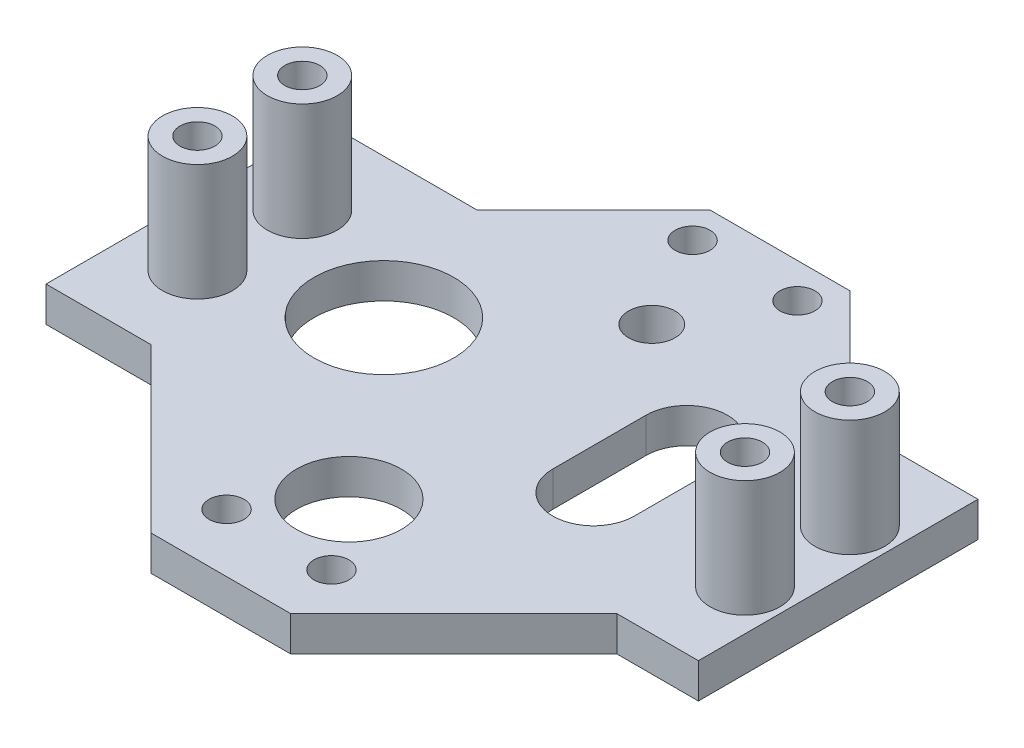
ISO-10303-21;
HEADER;
FILE_DESCRIPTION(('STEP AP214'),'2;1');
FILE_NAME('part.step','',(''),(''),'','','');
FILE_SCHEMA(('AUTOMOTIVE_DESIGN { 1 0 10303 214 1 1 1 1 }'));
ENDSEC;
DATA;
#1=APPLICATION_CONTEXT('core data for automotive mechanical design processes');
#2=APPLICATION_PROTOCOL_DEFINITION('international standard','automotive_design',2000,#1);
#3=PRODUCT_CONTEXT('',#1,'mechanical');
#4=PRODUCT('Part','Part','',(#3));
#5=PRODUCT_RELATED_PRODUCT_CATEGORY('part','',(#4));
#6=PRODUCT_DEFINITION_FORMATION('','',#4);
#7=PRODUCT_DEFINITION_CONTEXT('part definition',#1,'design');
#8=PRODUCT_DEFINITION('design','',#6,#7);
#9=PRODUCT_DEFINITION_SHAPE('','',#8);
#10=(LENGTH_UNIT() NAMED_UNIT(*) SI_UNIT(.MILLI.,.METRE.));
#11=(NAMED_UNIT(*) PLANE_ANGLE_UNIT() SI_UNIT($,.RADIAN.));
#12=(NAMED_UNIT(*) SI_UNIT($,.STERADIAN.) SOLID_ANGLE_UNIT());
#13=UNCERTAINTY_MEASURE_WITH_UNIT(LENGTH_MEASURE(1.E-05),#10,'distance_accuracy_value','');
#14=(GEOMETRIC_REPRESENTATION_CONTEXT(3) GLOBAL_UNCERTAINTY_ASSIGNED_CONTEXT((#13)) GLOBAL_UNIT_ASSIGNED_CONTEXT((#10,
#11,#12)) REPRESENTATION_CONTEXT('',''));
#15=CARTESIAN_POINT('',(0.,0.,0.));
#16=DIRECTION('',(0.,0.,1.));
#17=DIRECTION('',(1.,0.,0.));
#18=AXIS2_PLACEMENT_3D('',#15,#16,#17);
#19=CARTESIAN_POINT('',(0.,3.,-38.));
#20=DIRECTION('',(0.,0.,-1.));
#21=DIRECTION('',(-1.,0.,0.));
#22=AXIS2_PLACEMENT_3D('',#19,#20,#21);
#23=PLANE('',#22);
#24=DIRECTION('',(1.,0.,0.));
#25=VECTOR('',#24,1.);
#26=CARTESIAN_POINT('',(0.,0.,-38.));
#27=LINE('',#26,#25);
#28=CARTESIAN_POINT('',(22.0000000000003,0.,-38.));
#29=VERTEX_POINT('',#28);
#30=CARTESIAN_POINT('',(33.,0.,-38.));
#31=VERTEX_POINT('',#30);
#32=EDGE_CURVE('E250',#29,#31,#27,.T.);
#33=ORIENTED_EDGE('',*,*,#32,.F.);
#34=DIRECTION('',(0.,-1.,0.));
#35=VECTOR('',#34,1.);
#36=CARTESIAN_POINT('',(22.0000000000003,3.,-38.));
#37=LINE('',#36,#35);
#38=CARTESIAN_POINT('',(22.0000000000003,3.,-38.));
#39=VERTEX_POINT('',#38);
#40=EDGE_CURVE('E11',#39,#29,#37,.T.);
#41=ORIENTED_EDGE('',*,*,#40,.F.);
#42=DIRECTION('',(1.,0.,0.));
#43=VECTOR('',#42,1.);
#44=CARTESIAN_POINT('',(0.,3.,-38.));
#45=LINE('',#44,#43);
#46=CARTESIAN_POINT('',(33.,3.,-38.));
#47=VERTEX_POINT('',#46);
#48=EDGE_CURVE('E253',#39,#47,#45,.T.);
#49=ORIENTED_EDGE('',*,*,#48,.T.);
#50=DIRECTION('',(0.,-1.,0.));
#51=VECTOR('',#50,1.);
#52=CARTESIAN_POINT('',(33.,3.,-38.));
#53=LINE('',#52,#51);
#54=EDGE_CURVE('E284',#47,#31,#53,.T.);
#55=ORIENTED_EDGE('',*,*,#54,.T.);
#56=EDGE_LOOP('',(#33,#41,#49,#55));
#57=FACE_BOUND('',#56,.T.);
#58=ADVANCED_FACE('F34',(#57),#23,.T.);
#59=CARTESIAN_POINT('',(29.9999999999999,3.,-30.0000000000006));
#60=DIRECTION('',(0.707106781186539,0.,-0.707106781186556));
#61=DIRECTION('',(-0.707106781186556,0.,-0.707106781186539));
#62=AXIS2_PLACEMENT_3D('',#59,#60,#61);
#63=PLANE('',#62);
#64=DIRECTION('',(0.707106781186556,0.,0.707106781186539));
#65=VECTOR('',#64,1.);
#66=CARTESIAN_POINT('',(29.9999999999999,0.,-30.0000000000006));
#67=LINE('',#66,#65);
#68=CARTESIAN_POINT('',(12.,0.,-48.));
#69=VERTEX_POINT('',#68);
#70=EDGE_CURVE('E287',#69,#29,#67,.T.);
#71=ORIENTED_EDGE('',*,*,#70,.F.);
#72=DIRECTION('',(0.,-1.,0.));
#73=VECTOR('',#72,1.);
#74=CARTESIAN_POINT('',(12.,3.,-48.));
#75=LINE('',#74,#73);
#76=CARTESIAN_POINT('',(12.,3.,-48.));
#77=VERTEX_POINT('',#76);
#78=EDGE_CURVE('E41',#77,#69,#75,.T.);
#79=ORIENTED_EDGE('',*,*,#78,.F.);
#80=DIRECTION('',(0.707106781186556,0.,0.707106781186539));
#81=VECTOR('',#80,1.);
#82=CARTESIAN_POINT('',(29.9999999999999,3.,-30.0000000000006));
#83=LINE('',#82,#81);
#84=EDGE_CURVE('E256',#77,#39,#83,.T.);
#85=ORIENTED_EDGE('',*,*,#84,.T.);
#86=ORIENTED_EDGE('',*,*,#40,.T.);
#87=EDGE_LOOP('',(#71,#79,#85,#86));
#88=FACE_BOUND('',#87,.T.);
#89=ADVANCED_FACE('F344',(#88),#63,.T.);
#90=CARTESIAN_POINT('',(0.,3.,-48.));
#91=DIRECTION('',(0.,0.,-1.));
#92=DIRECTION('',(-1.,0.,0.));
#93=AXIS2_PLACEMENT_3D('',#90,#91,#92);
#94=PLANE('',#93);
#95=DIRECTION('',(1.,0.,0.));
#96=VECTOR('',#95,1.);
#97=CARTESIAN_POINT('',(0.,0.,-48.));
#98=LINE('',#97,#96);
#99=CARTESIAN_POINT('',(0.,0.,-48.));
#100=VERTEX_POINT('',#99);
#101=EDGE_CURVE('E290',#100,#69,#98,.T.);
#102=ORIENTED_EDGE('',*,*,#101,.F.);
#103=DIRECTION('',(0.,-1.,0.));
#104=VECTOR('',#103,1.);
#105=CARTESIAN_POINT('',(0.,3.,-48.));
#106=LINE('',#105,#104);
#107=CARTESIAN_POINT('',(0.,3.,-48.));
#108=VERTEX_POINT('',#107);
#109=EDGE_CURVE('E336',#108,#100,#106,.T.);
#110=ORIENTED_EDGE('',*,*,#109,.F.);
#111=DIRECTION('',(1.,0.,0.));
#112=VECTOR('',#111,1.);
#113=CARTESIAN_POINT('',(0.,3.,-48.));
#114=LINE('',#113,#112);
#115=EDGE_CURVE('E260',#108,#77,#114,.T.);
#116=ORIENTED_EDGE('',*,*,#115,.T.);
#117=ORIENTED_EDGE('',*,*,#78,.T.);
#118=EDGE_LOOP('',(#102,#110,#116,#117));
#119=FACE_BOUND('',#118,.T.);
#120=ADVANCED_FACE('F340',(#119),#94,.T.);
#121=CARTESIAN_POINT('',(-24.,3.,-23.9999999999996));
#122=DIRECTION('',(0.707106781186553,0.,0.707106781186541));
#123=DIRECTION('',(0.707106781186542,0.,-0.707106781186554));
#124=AXIS2_PLACEMENT_3D('',#121,#122,#123);
#125=PLANE('',#124);
#126=DIRECTION('',(-0.707106781186542,0.,0.707106781186554));
#127=VECTOR('',#126,1.);
#128=CARTESIAN_POINT('',(-24.,0.,-23.9999999999996));
#129=LINE('',#128,#127);
#130=CARTESIAN_POINT('',(-9.99999999999987,0.,-38.));
#131=VERTEX_POINT('',#130);
#132=EDGE_CURVE('E293',#100,#131,#129,.T.);
#133=ORIENTED_EDGE('',*,*,#132,.T.);
#134=DIRECTION('',(0.,-1.,0.));
#135=VECTOR('',#134,1.);
#136=CARTESIAN_POINT('',(-9.99999999999987,3.,-38.));
#137=LINE('',#136,#135);
#138=CARTESIAN_POINT('',(-9.99999999999987,3.,-38.));
#139=VERTEX_POINT('',#138);
#140=EDGE_CURVE('E334',#139,#131,#137,.T.);
#141=ORIENTED_EDGE('',*,*,#140,.F.);
#142=DIRECTION('',(-0.707106781186542,0.,0.707106781186554));
#143=VECTOR('',#142,1.);
#144=CARTESIAN_POINT('',(-24.,3.,-23.9999999999996));
#145=LINE('',#144,#143);
#146=EDGE_CURVE('E263',#108,#139,#145,.T.);
#147=ORIENTED_EDGE('',*,*,#146,.F.);
#148=ORIENTED_EDGE('',*,*,#109,.T.);
#149=EDGE_LOOP('',(#133,#141,#147,#148));
#150=FACE_BOUND('',#149,.T.);
#151=ADVANCED_FACE('F352',(#150),#125,.F.);
#152=CARTESIAN_POINT('',(0.,3.,-38.));
#153=DIRECTION('',(0.,0.,-1.));
#154=DIRECTION('',(-1.,0.,0.));
#155=AXIS2_PLACEMENT_3D('',#152,#153,#154);
#156=PLANE('',#155);
#157=DIRECTION('',(1.,0.,0.));
#158=VECTOR('',#157,1.);
#159=CARTESIAN_POINT('',(0.,0.,-38.));
#160=LINE('',#159,#158);
#161=CARTESIAN_POINT('',(-23.,0.,-38.));
#162=VERTEX_POINT('',#161);
#163=EDGE_CURVE('E296',#162,#131,#160,.T.);
#164=ORIENTED_EDGE('',*,*,#163,.F.);
#165=DIRECTION('',(0.,-1.,0.));
#166=VECTOR('',#165,1.);
#167=CARTESIAN_POINT('',(-23.,3.,-38.));
#168=LINE('',#167,#166);
#169=CARTESIAN_POINT('',(-23.,3.,-38.));
#170=VERTEX_POINT('',#169);
#171=EDGE_CURVE('E332',#170,#162,#168,.T.);
#172=ORIENTED_EDGE('',*,*,#171,.F.);
#173=DIRECTION('',(1.,0.,0.));
#174=VECTOR('',#173,1.);
#175=CARTESIAN_POINT('',(0.,3.,-38.));
#176=LINE('',#175,#174);
#177=EDGE_CURVE('E265',#170,#139,#176,.T.);
#178=ORIENTED_EDGE('',*,*,#177,.T.);
#179=ORIENTED_EDGE('',*,*,#140,.T.);
#180=EDGE_LOOP('',(#164,#172,#178,#179));
#181=FACE_BOUND('',#180,.T.);
#182=ADVANCED_FACE('F392',(#181),#156,.T.);
#183=CARTESIAN_POINT('',(-23.,3.,0.));
#184=DIRECTION('',(1.,0.,0.));
#185=DIRECTION('',(0.,0.,-1.));
#186=AXIS2_PLACEMENT_3D('',#183,#184,#185);
#187=PLANE('',#186);
#188=DIRECTION('',(0.,0.,1.));
#189=VECTOR('',#188,1.);
#190=CARTESIAN_POINT('',(-23.,0.,0.));
#191=LINE('',#190,#189);
#192=CARTESIAN_POINT('',(-23.,0.,-14.));
#193=VERTEX_POINT('',#192);
#194=EDGE_CURVE('E299',#162,#193,#191,.T.);
#195=ORIENTED_EDGE('',*,*,#194,.T.);
#196=DIRECTION('',(0.,-1.,0.));
#197=VECTOR('',#196,1.);
#198=CARTESIAN_POINT('',(-23.,3.,-14.));
#199=LINE('',#198,#197);
#200=CARTESIAN_POINT('',(-23.,3.,-14.));
#201=VERTEX_POINT('',#200);
#202=EDGE_CURVE('E329',#201,#193,#199,.T.);
#203=ORIENTED_EDGE('',*,*,#202,.F.);
#204=DIRECTION('',(0.,0.,1.));
#205=VECTOR('',#204,1.);
#206=CARTESIAN_POINT('',(-23.,3.,0.));
#207=LINE('',#206,#205);
#208=EDGE_CURVE('E268',#170,#201,#207,.T.);
#209=ORIENTED_EDGE('',*,*,#208,.F.);
#210=ORIENTED_EDGE('',*,*,#171,.T.);
#211=EDGE_LOOP('',(#195,#203,#209,#210));
#212=FACE_BOUND('',#211,.T.);
#213=ADVANCED_FACE('F390',(#212),#187,.F.);
#214=CARTESIAN_POINT('',(0.,3.,-14.));
#215=DIRECTION('',(0.,0.,-1.));
#216=DIRECTION('',(-1.,0.,0.));
#217=AXIS2_PLACEMENT_3D('',#214,#215,#216);
#218=PLANE('',#217);
#219=DIRECTION('',(1.,0.,0.));
#220=VECTOR('',#219,1.);
#221=CARTESIAN_POINT('',(0.,0.,-14.));
#222=LINE('',#221,#220);
#223=CARTESIAN_POINT('',(-14.,0.,-14.));
#224=VERTEX_POINT('',#223);
#225=EDGE_CURVE('E301',#193,#224,#222,.T.);
#226=ORIENTED_EDGE('',*,*,#225,.T.);
#227=DIRECTION('',(0.,-1.,0.));
#228=VECTOR('',#227,1.);
#229=CARTESIAN_POINT('',(-14.,3.,-14.));
#230=LINE('',#229,#228);
#231=CARTESIAN_POINT('',(-14.,3.,-14.));
#232=VERTEX_POINT('',#231);
#233=EDGE_CURVE('E327',#232,#224,#230,.T.);
#234=ORIENTED_EDGE('',*,*,#233,.F.);
#235=DIRECTION('',(1.,0.,0.));
#236=VECTOR('',#235,1.);
#237=CARTESIAN_POINT('',(0.,3.,-14.));
#238=LINE('',#237,#236);
#239=EDGE_CURVE('E270',#201,#232,#238,.T.);
#240=ORIENTED_EDGE('',*,*,#239,.F.);
#241=ORIENTED_EDGE('',*,*,#202,.T.);
#242=EDGE_LOOP('',(#226,#234,#240,#241));
#243=FACE_BOUND('',#242,.T.);
#244=ADVANCED_FACE('F385',(#243),#218,.F.);
#245=CARTESIAN_POINT('',(0.,3.,0.));
#246=DIRECTION('',(-0.707106781186546,0.,0.707106781186549));
#247=DIRECTION('',(0.707106781186549,0.,0.707106781186546));
#248=AXIS2_PLACEMENT_3D('',#245,#246,#247);
#249=PLANE('',#248);
#250=DIRECTION('',(-0.707106781186549,0.,-0.707106781186546));
#251=VECTOR('',#250,1.);
#252=CARTESIAN_POINT('',(0.,0.,0.));
#253=LINE('',#252,#251);
#254=CARTESIAN_POINT('',(0.,0.,0.));
#255=VERTEX_POINT('',#254);
#256=EDGE_CURVE('E304',#255,#224,#253,.T.);
#257=ORIENTED_EDGE('',*,*,#256,.F.);
#258=DIRECTION('',(0.,-1.,0.));
#259=VECTOR('',#258,1.);
#260=CARTESIAN_POINT('',(0.,3.,0.));
#261=LINE('',#260,#259);
#262=CARTESIAN_POINT('',(0.,3.,0.));
#263=VERTEX_POINT('',#262);
#264=EDGE_CURVE('E325',#263,#255,#261,.T.);
#265=ORIENTED_EDGE('',*,*,#264,.F.);
#266=DIRECTION('',(-0.707106781186549,0.,-0.707106781186546));
#267=VECTOR('',#266,1.);
#268=CARTESIAN_POINT('',(0.,3.,0.));
#269=LINE('',#268,#267);
#270=EDGE_CURVE('E272',#263,#232,#269,.T.);
#271=ORIENTED_EDGE('',*,*,#270,.T.);
#272=ORIENTED_EDGE('',*,*,#233,.T.);
#273=EDGE_LOOP('',(#257,#265,#271,#272));
#274=FACE_BOUND('',#273,.T.);
#275=ADVANCED_FACE('F381',(#274),#249,.T.);
#276=CARTESIAN_POINT('',(0.,3.,0.));
#277=DIRECTION('',(0.,0.,-1.));
#278=DIRECTION('',(-1.,0.,0.));
#279=AXIS2_PLACEMENT_3D('',#276,#277,#278);
#280=PLANE('',#279);
#281=DIRECTION('',(1.,0.,0.));
#282=VECTOR('',#281,1.);
#283=CARTESIAN_POINT('',(0.,0.,0.));
#284=LINE('',#283,#282);
#285=CARTESIAN_POINT('',(12.,0.,0.));
#286=VERTEX_POINT('',#285);
#287=EDGE_CURVE('E307',#255,#286,#284,.T.);
#288=ORIENTED_EDGE('',*,*,#287,.T.);
#289=DIRECTION('',(0.,-1.,0.));
#290=VECTOR('',#289,1.);
#291=CARTESIAN_POINT('',(12.,3.,0.));
#292=LINE('',#291,#290);
#293=CARTESIAN_POINT('',(12.,3.,0.));
#294=VERTEX_POINT('',#293);
#295=EDGE_CURVE('E322',#294,#286,#292,.T.);
#296=ORIENTED_EDGE('',*,*,#295,.F.);
#297=DIRECTION('',(1.,0.,0.));
#298=VECTOR('',#297,1.);
#299=CARTESIAN_POINT('',(0.,3.,0.));
#300=LINE('',#299,#298);
#301=EDGE_CURVE('E275',#263,#294,#300,.T.);
#302=ORIENTED_EDGE('',*,*,#301,.F.);
#303=ORIENTED_EDGE('',*,*,#264,.T.);
#304=EDGE_LOOP('',(#288,#296,#302,#303));
#305=FACE_BOUND('',#304,.T.);
#306=ADVANCED_FACE('F378',(#305),#280,.F.);
#307=CARTESIAN_POINT('',(5.99999999999998,3.,6.));
#308=DIRECTION('',(-0.707106781186546,0.,-0.707106781186548));
#309=DIRECTION('',(-0.707106781186549,0.,0.707106781186546));
#310=AXIS2_PLACEMENT_3D('',#307,#308,#309);
#311=PLANE('',#310);
#312=DIRECTION('',(0.707106781186549,0.,-0.707106781186546));
#313=VECTOR('',#312,1.);
#314=CARTESIAN_POINT('',(5.99999999999998,0.,6.));
#315=LINE('',#314,#313);
#316=CARTESIAN_POINT('',(26.,0.,-14.));
#317=VERTEX_POINT('',#316);
#318=EDGE_CURVE('E309',#286,#317,#315,.T.);
#319=ORIENTED_EDGE('',*,*,#318,.T.);
#320=DIRECTION('',(0.,-1.,0.));
#321=VECTOR('',#320,1.);
#322=CARTESIAN_POINT('',(26.,3.,-14.));
#323=LINE('',#322,#321);
#324=CARTESIAN_POINT('',(26.,3.,-14.));
#325=VERTEX_POINT('',#324);
#326=EDGE_CURVE('E319',#325,#317,#323,.T.);
#327=ORIENTED_EDGE('',*,*,#326,.F.);
#328=DIRECTION('',(0.707106781186549,0.,-0.707106781186546));
#329=VECTOR('',#328,1.);
#330=CARTESIAN_POINT('',(5.99999999999998,3.,6.));
#331=LINE('',#330,#329);
#332=EDGE_CURVE('E277',#294,#325,#331,.T.);
#333=ORIENTED_EDGE('',*,*,#332,.F.);
#334=ORIENTED_EDGE('',*,*,#295,.T.);
#335=EDGE_LOOP('',(#319,#327,#333,#334));
#336=FACE_BOUND('',#335,.T.);
#337=ADVANCED_FACE('F373',(#336),#311,.F.);
#338=CARTESIAN_POINT('',(0.,3.,-14.));
#339=DIRECTION('',(0.,0.,-1.));
#340=DIRECTION('',(-1.,0.,0.));
#341=AXIS2_PLACEMENT_3D('',#338,#339,#340);
#342=PLANE('',#341);
#343=DIRECTION('',(1.,0.,0.));
#344=VECTOR('',#343,1.);
#345=CARTESIAN_POINT('',(0.,0.,-14.));
#346=LINE('',#345,#344);
#347=CARTESIAN_POINT('',(33.,0.,-14.));
#348=VERTEX_POINT('',#347);
#349=EDGE_CURVE('E311',#317,#348,#346,.T.);
#350=ORIENTED_EDGE('',*,*,#349,.T.);
#351=DIRECTION('',(0.,-1.,0.));
#352=VECTOR('',#351,1.);
#353=CARTESIAN_POINT('',(33.,3.,-14.));
#354=LINE('',#353,#352);
#355=CARTESIAN_POINT('',(33.,3.,-14.));
#356=VERTEX_POINT('',#355);
#357=EDGE_CURVE('E317',#356,#348,#354,.T.);
#358=ORIENTED_EDGE('',*,*,#357,.F.);
#359=DIRECTION('',(1.,0.,0.));
#360=VECTOR('',#359,1.);
#361=CARTESIAN_POINT('',(0.,3.,-14.));
#362=LINE('',#361,#360);
#363=EDGE_CURVE('E279',#325,#356,#362,.T.);
#364=ORIENTED_EDGE('',*,*,#363,.F.);
#365=ORIENTED_EDGE('',*,*,#326,.T.);
#366=EDGE_LOOP('',(#350,#358,#364,#365));
#367=FACE_BOUND('',#366,.T.);
#368=ADVANCED_FACE('F367',(#367),#342,.F.);
#369=CARTESIAN_POINT('',(33.,3.,0.));
#370=DIRECTION('',(1.,0.,0.));
#371=DIRECTION('',(0.,0.,-1.));
#372=AXIS2_PLACEMENT_3D('',#369,#370,#371);
#373=PLANE('',#372);
#374=DIRECTION('',(0.,0.,1.));
#375=VECTOR('',#374,1.);
#376=CARTESIAN_POINT('',(33.,0.,0.));
#377=LINE('',#376,#375);
#378=EDGE_CURVE('E257',#31,#348,#377,.T.);
#379=ORIENTED_EDGE('',*,*,#378,.F.);
#380=ORIENTED_EDGE('',*,*,#54,.F.);
#381=DIRECTION('',(0.,0.,1.));
#382=VECTOR('',#381,1.);
#383=CARTESIAN_POINT('',(33.,3.,0.));
#384=LINE('',#383,#382);
#385=EDGE_CURVE('E281',#47,#356,#384,.T.);
#386=ORIENTED_EDGE('',*,*,#385,.T.);
#387=ORIENTED_EDGE('',*,*,#357,.T.);
#388=EDGE_LOOP('',(#379,#380,#386,#387));
#389=FACE_BOUND('',#388,.T.);
#390=ADVANCED_FACE('F363',(#389),#373,.T.);
#391=CARTESIAN_POINT('',(0.,3.,0.));
#392=DIRECTION('',(0.,1.,0.));
#393=DIRECTION('',(0.,0.,1.));
#394=AXIS2_PLACEMENT_3D('',#391,#392,#393);
#395=PLANE('',#394);
#396=CARTESIAN_POINT('',(23.,3.,-26.));
#397=DIRECTION('',(0.,1.,0.));
#398=DIRECTION('',(0.,0.,1.));
#399=AXIS2_PLACEMENT_3D('',#396,#397,#398);
#400=CIRCLE('',#399,1.5);
#401=CARTESIAN_POINT('',(23.,3.,-24.5));
#402=VERTEX_POINT('',#401);
#403=EDGE_CURVE('E169',#402,#402,#400,.T.);
#404=ORIENTED_EDGE('',*,*,#403,.F.);
#405=EDGE_LOOP('',(#404));
#406=FACE_BOUND('',#405,.T.);
#407=CARTESIAN_POINT('',(16.,3.,-22.));
#408=DIRECTION('',(0.,1.,0.));
#409=DIRECTION('',(0.,0.,1.));
#410=AXIS2_PLACEMENT_3D('',#407,#408,#409);
#411=CIRCLE('',#410,3.5);
#412=CARTESIAN_POINT('',(12.5,3.,-22.));
#413=VERTEX_POINT('',#412);
#414=CARTESIAN_POINT('',(19.5,3.,-22.));
#415=VERTEX_POINT('',#414);
#416=EDGE_CURVE('E48',#413,#415,#411,.T.);
#417=ORIENTED_EDGE('',*,*,#416,.F.);
#418=DIRECTION('',(0.,0.,1.));
#419=VECTOR('',#418,1.);
#420=CARTESIAN_POINT('',(12.5,3.,-22.));
#421=LINE('',#420,#419);
#422=CARTESIAN_POINT('',(12.5,3.,-30.));
#423=VERTEX_POINT('',#422);
#424=EDGE_CURVE('E163',#423,#413,#421,.T.);
#425=ORIENTED_EDGE('',*,*,#424,.F.);
#426=CARTESIAN_POINT('',(16.,3.,-30.));
#427=DIRECTION('',(0.,1.,0.));
#428=DIRECTION('',(0.,0.,1.));
#429=AXIS2_PLACEMENT_3D('',#426,#427,#428);
#430=CIRCLE('',#429,3.5);
#431=CARTESIAN_POINT('',(19.5,3.,-30.));
#432=VERTEX_POINT('',#431);
#433=EDGE_CURVE('E166',#432,#423,#430,.T.);
#434=ORIENTED_EDGE('',*,*,#433,.F.);
#435=DIRECTION('',(0.,0.,-1.));
#436=VECTOR('',#435,1.);
#437=CARTESIAN_POINT('',(19.5,3.,-22.));
#438=LINE('',#437,#436);
#439=EDGE_CURVE('E175',#415,#432,#438,.T.);
#440=ORIENTED_EDGE('',*,*,#439,.F.);
#441=EDGE_LOOP('',(#417,#425,#434,#440));
#442=FACE_BOUND('',#441,.T.);
#443=CARTESIAN_POINT('',(-6.,3.,-26.));
#444=DIRECTION('',(0.,1.,0.));
#445=DIRECTION('',(0.,0.,1.));
#446=AXIS2_PLACEMENT_3D('',#443,#444,#445);
#447=CIRCLE('',#446,6.);
#448=CARTESIAN_POINT('',(-6.,3.,-20.));
#449=VERTEX_POINT('',#448);
#450=EDGE_CURVE('E187',#449,#449,#447,.T.);
#451=ORIENTED_EDGE('',*,*,#450,.F.);
#452=EDGE_LOOP('',(#451));
#453=FACE_BOUND('',#452,.T.);
#454=CARTESIAN_POINT('',(29.5,3.,-21.5));
#455=DIRECTION('',(0.,1.,0.));
#456=DIRECTION('',(0.,0.,1.));
#457=AXIS2_PLACEMENT_3D('',#454,#455,#456);
#458=CIRCLE('',#457,3.);
#459=CARTESIAN_POINT('',(29.5,3.,-18.5));
#460=VERTEX_POINT('',#459);
#461=EDGE_CURVE('E195',#460,#460,#458,.T.);
#462=ORIENTED_EDGE('',*,*,#461,.F.);
#463=EDGE_LOOP('',(#462));
#464=FACE_BOUND('',#463,.T.);
#465=CARTESIAN_POINT('',(29.5,3.,-30.5));
#466=DIRECTION('',(0.,1.,0.));
#467=DIRECTION('',(0.,0.,1.));
#468=AXIS2_PLACEMENT_3D('',#465,#466,#467);
#469=CIRCLE('',#468,3.);
#470=CARTESIAN_POINT('',(29.5,3.,-27.5));
#471=VERTEX_POINT('',#470);
#472=EDGE_CURVE('E194',#471,#471,#469,.T.);
#473=ORIENTED_EDGE('',*,*,#472,.F.);
#474=EDGE_LOOP('',(#473));
#475=FACE_BOUND('',#474,.T.);
#476=CARTESIAN_POINT('',(-17.5,3.,-21.5));
#477=DIRECTION('',(0.,1.,0.));
#478=DIRECTION('',(0.,0.,1.));
#479=AXIS2_PLACEMENT_3D('',#476,#477,#478);
#480=CIRCLE('',#479,3.);
#481=CARTESIAN_POINT('',(-17.5,3.,-18.5));
#482=VERTEX_POINT('',#481);
#483=EDGE_CURVE('E202',#482,#482,#480,.T.);
#484=ORIENTED_EDGE('',*,*,#483,.F.);
#485=EDGE_LOOP('',(#484));
#486=FACE_BOUND('',#485,.T.);
#487=CARTESIAN_POINT('',(-17.5,3.,-30.5));
#488=DIRECTION('',(0.,1.,0.));
#489=DIRECTION('',(0.,0.,1.));
#490=AXIS2_PLACEMENT_3D('',#487,#488,#489);
#491=CIRCLE('',#490,3.);
#492=CARTESIAN_POINT('',(-17.5,3.,-27.5));
#493=VERTEX_POINT('',#492);
#494=EDGE_CURVE('E208',#493,#493,#491,.T.);
#495=ORIENTED_EDGE('',*,*,#494,.F.);
#496=EDGE_LOOP('',(#495));
#497=FACE_BOUND('',#496,.T.);
#498=CARTESIAN_POINT('',(10.5,3.,-45.));
#499=DIRECTION('',(0.,1.,0.));
#500=DIRECTION('',(0.,0.,1.));
#501=AXIS2_PLACEMENT_3D('',#498,#499,#500);
#502=CIRCLE('',#501,1.5);
#503=CARTESIAN_POINT('',(10.5,3.,-43.5));
#504=VERTEX_POINT('',#503);
#505=EDGE_CURVE('E227',#504,#504,#502,.T.);
#506=ORIENTED_EDGE('',*,*,#505,.F.);
#507=EDGE_LOOP('',(#506));
#508=FACE_BOUND('',#507,.T.);
#509=CARTESIAN_POINT('',(1.5,3.,-45.));
#510=DIRECTION('',(0.,1.,0.));
#511=DIRECTION('',(0.,0.,1.));
#512=AXIS2_PLACEMENT_3D('',#509,#510,#511);
#513=CIRCLE('',#512,1.5);
#514=CARTESIAN_POINT('',(1.5,3.,-43.5));
#515=VERTEX_POINT('',#514);
#516=EDGE_CURVE('E233',#515,#515,#513,.T.);
#517=ORIENTED_EDGE('',*,*,#516,.F.);
#518=EDGE_LOOP('',(#517));
#519=FACE_BOUND('',#518,.T.);
#520=CARTESIAN_POINT('',(10.5,3.,-5.));
#521=DIRECTION('',(0.,1.,0.));
#522=DIRECTION('',(0.,0.,1.));
#523=AXIS2_PLACEMENT_3D('',#520,#521,#522);
#524=CIRCLE('',#523,1.5);
#525=CARTESIAN_POINT('',(10.5,3.,-3.5));
#526=VERTEX_POINT('',#525);
#527=EDGE_CURVE('E220',#526,#526,#524,.T.);
#528=ORIENTED_EDGE('',*,*,#527,.F.);
#529=EDGE_LOOP('',(#528));
#530=FACE_BOUND('',#529,.T.);
#531=CARTESIAN_POINT('',(6.,3.,-11.));
#532=DIRECTION('',(0.,1.,0.));
#533=DIRECTION('',(0.,0.,1.));
#534=AXIS2_PLACEMENT_3D('',#531,#532,#533);
#535=CIRCLE('',#534,4.5);
#536=CARTESIAN_POINT('',(6.,3.,-6.5));
#537=VERTEX_POINT('',#536);
#538=EDGE_CURVE('E240',#537,#537,#535,.T.);
#539=ORIENTED_EDGE('',*,*,#538,.F.);
#540=EDGE_LOOP('',(#539));
#541=FACE_BOUND('',#540,.T.);
#542=CARTESIAN_POINT('',(1.5,3.,-5.));
#543=DIRECTION('',(0.,1.,0.));
#544=DIRECTION('',(0.,0.,1.));
#545=AXIS2_PLACEMENT_3D('',#542,#543,#544);
#546=CIRCLE('',#545,1.5);
#547=CARTESIAN_POINT('',(1.5,3.,-3.5));
#548=VERTEX_POINT('',#547);
#549=EDGE_CURVE('E214',#548,#548,#546,.T.);
#550=ORIENTED_EDGE('',*,*,#549,.F.);
#551=EDGE_LOOP('',(#550));
#552=FACE_BOUND('',#551,.T.);
#553=CARTESIAN_POINT('',(6.,3.,-37.));
#554=DIRECTION('',(0.,1.,0.));
#555=DIRECTION('',(0.,0.,1.));
#556=AXIS2_PLACEMENT_3D('',#553,#554,#555);
#557=CIRCLE('',#556,2.);
#558=CARTESIAN_POINT('',(6.,3.,-35.));
#559=VERTEX_POINT('',#558);
#560=EDGE_CURVE('E226',#559,#559,#557,.T.);
#561=ORIENTED_EDGE('',*,*,#560,.F.);
#562=EDGE_LOOP('',(#561));
#563=FACE_BOUND('',#562,.T.);
#564=ORIENTED_EDGE('',*,*,#48,.F.);
#565=ORIENTED_EDGE('',*,*,#84,.F.);
#566=ORIENTED_EDGE('',*,*,#115,.F.);
#567=ORIENTED_EDGE('',*,*,#146,.T.);
#568=ORIENTED_EDGE('',*,*,#177,.F.);
#569=ORIENTED_EDGE('',*,*,#208,.T.);
#570=ORIENTED_EDGE('',*,*,#239,.T.);
#571=ORIENTED_EDGE('',*,*,#270,.F.);
#572=ORIENTED_EDGE('',*,*,#301,.T.);
#573=ORIENTED_EDGE('',*,*,#332,.T.);
#574=ORIENTED_EDGE('',*,*,#363,.T.);
#575=ORIENTED_EDGE('',*,*,#385,.F.);
#576=EDGE_LOOP('',(#564,#565,#566,#567,#568,#569,#570,#571,#572,#573,#574,#575));
#577=FACE_BOUND('',#576,.T.);
#578=ADVANCED_FACE('F357',(#406,#442,#453,#464,#475,#486,#497,#508,#519,#530,#541,#552,#563,
#577),#395,.T.);
#579=CARTESIAN_POINT('',(0.,0.,0.));
#580=DIRECTION('',(0.,1.,0.));
#581=DIRECTION('',(0.,0.,1.));
#582=AXIS2_PLACEMENT_3D('',#579,#580,#581);
#583=PLANE('',#582);
#584=CARTESIAN_POINT('',(23.,0.,-26.));
#585=DIRECTION('',(0.,1.,0.));
#586=DIRECTION('',(0.,0.,1.));
#587=AXIS2_PLACEMENT_3D('',#584,#585,#586);
#588=CIRCLE('',#587,1.5);
#589=CARTESIAN_POINT('',(23.,0.,-24.5));
#590=VERTEX_POINT('',#589);
#591=EDGE_CURVE('E198',#590,#590,#588,.T.);
#592=ORIENTED_EDGE('',*,*,#591,.T.);
#593=EDGE_LOOP('',(#592));
#594=FACE_BOUND('',#593,.T.);
#595=DIRECTION('',(0.,0.,1.));
#596=VECTOR('',#595,1.);
#597=CARTESIAN_POINT('',(12.5,0.,-22.));
#598=LINE('',#597,#596);
#599=CARTESIAN_POINT('',(12.5,0.,-30.));
#600=VERTEX_POINT('',#599);
#601=CARTESIAN_POINT('',(12.5,0.,-22.));
#602=VERTEX_POINT('',#601);
#603=EDGE_CURVE('E153',#600,#602,#598,.T.);
#604=ORIENTED_EDGE('',*,*,#603,.T.);
#605=CARTESIAN_POINT('',(16.,0.,-22.));
#606=DIRECTION('',(0.,1.,0.));
#607=DIRECTION('',(0.,0.,1.));
#608=AXIS2_PLACEMENT_3D('',#605,#606,#607);
#609=CIRCLE('',#608,3.5);
#610=CARTESIAN_POINT('',(19.5,0.,-22.));
#611=VERTEX_POINT('',#610);
#612=EDGE_CURVE('E147',#602,#611,#609,.T.);
#613=ORIENTED_EDGE('',*,*,#612,.T.);
#614=DIRECTION('',(0.,0.,-1.));
#615=VECTOR('',#614,1.);
#616=CARTESIAN_POINT('',(19.5,0.,-22.));
#617=LINE('',#616,#615);
#618=CARTESIAN_POINT('',(19.5,0.,-30.));
#619=VERTEX_POINT('',#618);
#620=EDGE_CURVE('E156',#611,#619,#617,.T.);
#621=ORIENTED_EDGE('',*,*,#620,.T.);
#622=CARTESIAN_POINT('',(16.,0.,-30.));
#623=DIRECTION('',(0.,1.,0.));
#624=DIRECTION('',(0.,0.,1.));
#625=AXIS2_PLACEMENT_3D('',#622,#623,#624);
#626=CIRCLE('',#625,3.5);
#627=EDGE_CURVE('E56',#619,#600,#626,.T.);
#628=ORIENTED_EDGE('',*,*,#627,.T.);
#629=EDGE_LOOP('',(#604,#613,#621,#628));
#630=FACE_BOUND('',#629,.T.);
#631=CARTESIAN_POINT('',(-6.,0.,-26.));
#632=DIRECTION('',(0.,1.,0.));
#633=DIRECTION('',(0.,0.,1.));
#634=AXIS2_PLACEMENT_3D('',#631,#632,#633);
#635=CIRCLE('',#634,6.);
#636=CARTESIAN_POINT('',(-6.,0.,-20.));
#637=VERTEX_POINT('',#636);
#638=EDGE_CURVE('E176',#637,#637,#635,.T.);
#639=ORIENTED_EDGE('',*,*,#638,.T.);
#640=EDGE_LOOP('',(#639));
#641=FACE_BOUND('',#640,.T.);
#642=CARTESIAN_POINT('',(10.5,0.,-45.));
#643=DIRECTION('',(0.,1.,0.));
#644=DIRECTION('',(0.,0.,1.));
#645=AXIS2_PLACEMENT_3D('',#642,#643,#644);
#646=CIRCLE('',#645,1.5);
#647=CARTESIAN_POINT('',(10.5,0.,-43.5));
#648=VERTEX_POINT('',#647);
#649=EDGE_CURVE('E223',#648,#648,#646,.T.);
#650=ORIENTED_EDGE('',*,*,#649,.T.);
#651=EDGE_LOOP('',(#650));
#652=FACE_BOUND('',#651,.T.);
#653=CARTESIAN_POINT('',(1.5,0.,-45.));
#654=DIRECTION('',(0.,1.,0.));
#655=DIRECTION('',(0.,0.,1.));
#656=AXIS2_PLACEMENT_3D('',#653,#654,#655);
#657=CIRCLE('',#656,1.5);
#658=CARTESIAN_POINT('',(1.5,0.,-43.5));
#659=VERTEX_POINT('',#658);
#660=EDGE_CURVE('E230',#659,#659,#657,.T.);
#661=ORIENTED_EDGE('',*,*,#660,.T.);
#662=EDGE_LOOP('',(#661));
#663=FACE_BOUND('',#662,.T.);
#664=CARTESIAN_POINT('',(10.5,0.,-5.));
#665=DIRECTION('',(0.,1.,0.));
#666=DIRECTION('',(0.,0.,1.));
#667=AXIS2_PLACEMENT_3D('',#664,#665,#666);
#668=CIRCLE('',#667,1.5);
#669=CARTESIAN_POINT('',(10.5,0.,-3.5));
#670=VERTEX_POINT('',#669);
#671=EDGE_CURVE('E237',#670,#670,#668,.T.);
#672=ORIENTED_EDGE('',*,*,#671,.T.);
#673=EDGE_LOOP('',(#672));
#674=FACE_BOUND('',#673,.T.);
#675=CARTESIAN_POINT('',(6.,0.,-11.));
#676=DIRECTION('',(0.,1.,0.));
#677=DIRECTION('',(0.,0.,1.));
#678=AXIS2_PLACEMENT_3D('',#675,#676,#677);
#679=CIRCLE('',#678,4.5);
#680=CARTESIAN_POINT('',(6.,0.,-6.5));
#681=VERTEX_POINT('',#680);
#682=EDGE_CURVE('E236',#681,#681,#679,.T.);
#683=ORIENTED_EDGE('',*,*,#682,.T.);
#684=EDGE_LOOP('',(#683));
#685=FACE_BOUND('',#684,.T.);
#686=CARTESIAN_POINT('',(1.5,0.,-5.));
#687=DIRECTION('',(0.,1.,0.));
#688=DIRECTION('',(0.,0.,1.));
#689=AXIS2_PLACEMENT_3D('',#686,#687,#688);
#690=CIRCLE('',#689,1.5);
#691=CARTESIAN_POINT('',(1.5,0.,-3.5));
#692=VERTEX_POINT('',#691);
#693=EDGE_CURVE('E217',#692,#692,#690,.T.);
#694=ORIENTED_EDGE('',*,*,#693,.T.);
#695=EDGE_LOOP('',(#694));
#696=FACE_BOUND('',#695,.T.);
#697=CARTESIAN_POINT('',(6.,0.,-37.));
#698=DIRECTION('',(0.,1.,0.));
#699=DIRECTION('',(0.,0.,1.));
#700=AXIS2_PLACEMENT_3D('',#697,#698,#699);
#701=CIRCLE('',#700,2.);
#702=CARTESIAN_POINT('',(6.,0.,-35.));
#703=VERTEX_POINT('',#702);
#704=EDGE_CURVE('E247',#703,#703,#701,.T.);
#705=ORIENTED_EDGE('',*,*,#704,.T.);
#706=EDGE_LOOP('',(#705));
#707=FACE_BOUND('',#706,.T.);
#708=ORIENTED_EDGE('',*,*,#32,.T.);
#709=ORIENTED_EDGE('',*,*,#378,.T.);
#710=ORIENTED_EDGE('',*,*,#349,.F.);
#711=ORIENTED_EDGE('',*,*,#318,.F.);
#712=ORIENTED_EDGE('',*,*,#287,.F.);
#713=ORIENTED_EDGE('',*,*,#256,.T.);
#714=ORIENTED_EDGE('',*,*,#225,.F.);
#715=ORIENTED_EDGE('',*,*,#194,.F.);
#716=ORIENTED_EDGE('',*,*,#163,.T.);
#717=ORIENTED_EDGE('',*,*,#132,.F.);
#718=ORIENTED_EDGE('',*,*,#101,.T.);
#719=ORIENTED_EDGE('',*,*,#70,.T.);
#720=EDGE_LOOP('',(#708,#709,#710,#711,#712,#713,#714,#715,#716,#717,#718,#719));
#721=FACE_BOUND('',#720,.T.);
#722=ADVANCED_FACE('F160',(#594,#630,#641,#652,#663,#674,#685,#696,#707,#721),#583,.F.);
#723=CARTESIAN_POINT('',(6.,0.,-37.));
#724=DIRECTION('',(0.,1.,0.));
#725=DIRECTION('',(0.,0.,1.));
#726=AXIS2_PLACEMENT_3D('',#723,#724,#725);
#727=CYLINDRICAL_SURFACE('',#726,2.);
#728=ORIENTED_EDGE('',*,*,#704,.F.);
#729=EDGE_LOOP('',(#728));
#730=FACE_BOUND('',#729,.T.);
#731=ORIENTED_EDGE('',*,*,#560,.T.);
#732=EDGE_LOOP('',(#731));
#733=FACE_BOUND('',#732,.T.);
#734=ADVANCED_FACE('F480',(#730,#733),#727,.F.);
#735=CARTESIAN_POINT('',(1.5,0.,-5.));
#736=DIRECTION('',(0.,1.,0.));
#737=DIRECTION('',(0.,0.,1.));
#738=AXIS2_PLACEMENT_3D('',#735,#736,#737);
#739=CYLINDRICAL_SURFACE('',#738,1.5);
#740=ORIENTED_EDGE('',*,*,#693,.F.);
#741=EDGE_LOOP('',(#740));
#742=FACE_BOUND('',#741,.T.);
#743=ORIENTED_EDGE('',*,*,#549,.T.);
#744=EDGE_LOOP('',(#743));
#745=FACE_BOUND('',#744,.T.);
#746=ADVANCED_FACE('F485',(#742,#745),#739,.F.);
#747=CARTESIAN_POINT('',(6.,0.,-11.));
#748=DIRECTION('',(0.,1.,0.));
#749=DIRECTION('',(0.,0.,1.));
#750=AXIS2_PLACEMENT_3D('',#747,#748,#749);
#751=CYLINDRICAL_SURFACE('',#750,4.5);
#752=ORIENTED_EDGE('',*,*,#682,.F.);
#753=EDGE_LOOP('',(#752));
#754=FACE_BOUND('',#753,.T.);
#755=ORIENTED_EDGE('',*,*,#538,.T.);
#756=EDGE_LOOP('',(#755));
#757=FACE_BOUND('',#756,.T.);
#758=ADVANCED_FACE('F497',(#754,#757),#751,.F.);
#759=CARTESIAN_POINT('',(10.5,0.,-5.));
#760=DIRECTION('',(0.,1.,0.));
#761=DIRECTION('',(0.,0.,1.));
#762=AXIS2_PLACEMENT_3D('',#759,#760,#761);
#763=CYLINDRICAL_SURFACE('',#762,1.5);
#764=ORIENTED_EDGE('',*,*,#671,.F.);
#765=EDGE_LOOP('',(#764));
#766=FACE_BOUND('',#765,.T.);
#767=ORIENTED_EDGE('',*,*,#527,.T.);
#768=EDGE_LOOP('',(#767));
#769=FACE_BOUND('',#768,.T.);
#770=ADVANCED_FACE('F507',(#766,#769),#763,.F.);
#771=CARTESIAN_POINT('',(1.5,0.,-45.));
#772=DIRECTION('',(0.,1.,0.));
#773=DIRECTION('',(0.,0.,1.));
#774=AXIS2_PLACEMENT_3D('',#771,#772,#773);
#775=CYLINDRICAL_SURFACE('',#774,1.5);
#776=ORIENTED_EDGE('',*,*,#660,.F.);
#777=EDGE_LOOP('',(#776));
#778=FACE_BOUND('',#777,.T.);
#779=ORIENTED_EDGE('',*,*,#516,.T.);
#780=EDGE_LOOP('',(#779));
#781=FACE_BOUND('',#780,.T.);
#782=ADVANCED_FACE('F517',(#778,#781),#775,.F.);
#783=CARTESIAN_POINT('',(10.5,0.,-45.));
#784=DIRECTION('',(0.,1.,0.));
#785=DIRECTION('',(0.,0.,1.));
#786=AXIS2_PLACEMENT_3D('',#783,#784,#785);
#787=CYLINDRICAL_SURFACE('',#786,1.5);
#788=ORIENTED_EDGE('',*,*,#649,.F.);
#789=EDGE_LOOP('',(#788));
#790=FACE_BOUND('',#789,.T.);
#791=ORIENTED_EDGE('',*,*,#505,.T.);
#792=EDGE_LOOP('',(#791));
#793=FACE_BOUND('',#792,.T.);
#794=ADVANCED_FACE('F527',(#790,#793),#787,.F.);
#795=CARTESIAN_POINT('',(-17.5,13.,-30.5));
#796=DIRECTION('',(0.,-1.,0.));
#797=DIRECTION('',(0.,0.,-1.));
#798=AXIS2_PLACEMENT_3D('',#795,#796,#797);
#799=CYLINDRICAL_SURFACE('',#798,3.);
#800=CARTESIAN_POINT('',(-17.5,13.,-30.5));
#801=DIRECTION('',(0.,1.,0.));
#802=DIRECTION('',(0.,0.,1.));
#803=AXIS2_PLACEMENT_3D('',#800,#801,#802);
#804=CIRCLE('',#803,3.);
#805=CARTESIAN_POINT('',(-17.5,13.,-27.5));
#806=VERTEX_POINT('',#805);
#807=EDGE_CURVE('E211',#806,#806,#804,.T.);
#808=ORIENTED_EDGE('',*,*,#807,.F.);
#809=EDGE_LOOP('',(#808));
#810=FACE_BOUND('',#809,.T.);
#811=ORIENTED_EDGE('',*,*,#494,.T.);
#812=EDGE_LOOP('',(#811));
#813=FACE_BOUND('',#812,.T.);
#814=ADVANCED_FACE('F537',(#810,#813),#799,.T.);
#815=CARTESIAN_POINT('',(-17.5,13.,-30.5));
#816=DIRECTION('',(0.,1.,0.));
#817=DIRECTION('',(0.,0.,1.));
#818=AXIS2_PLACEMENT_3D('',#815,#816,#817);
#819=PLANE('',#818);
#820=CARTESIAN_POINT('',(-17.5,13.,-30.5));
#821=DIRECTION('',(0.,1.,0.));
#822=DIRECTION('',(0.,0.,1.));
#823=AXIS2_PLACEMENT_3D('',#820,#821,#822);
#824=CIRCLE('',#823,1.5);
#825=CARTESIAN_POINT('',(-17.5,13.,-29.));
#826=VERTEX_POINT('',#825);
#827=EDGE_CURVE('E778',#826,#826,#824,.T.);
#828=ORIENTED_EDGE('',*,*,#827,.F.);
#829=EDGE_LOOP('',(#828));
#830=FACE_BOUND('',#829,.T.);
#831=ORIENTED_EDGE('',*,*,#807,.T.);
#832=EDGE_LOOP('',(#831));
#833=FACE_BOUND('',#832,.T.);
#834=ADVANCED_FACE('F547',(#830,#833),#819,.T.);
#835=CARTESIAN_POINT('',(-17.5,13.,-21.5));
#836=DIRECTION('',(0.,-1.,0.));
#837=DIRECTION('',(0.,0.,-1.));
#838=AXIS2_PLACEMENT_3D('',#835,#836,#837);
#839=CYLINDRICAL_SURFACE('',#838,3.);
#840=CARTESIAN_POINT('',(-17.5,13.,-21.5));
#841=DIRECTION('',(0.,1.,0.));
#842=DIRECTION('',(0.,0.,1.));
#843=AXIS2_PLACEMENT_3D('',#840,#841,#842);
#844=CIRCLE('',#843,3.);
#845=CARTESIAN_POINT('',(-17.5,13.,-18.5));
#846=VERTEX_POINT('',#845);
#847=EDGE_CURVE('E205',#846,#846,#844,.T.);
#848=ORIENTED_EDGE('',*,*,#847,.F.);
#849=EDGE_LOOP('',(#848));
#850=FACE_BOUND('',#849,.T.);
#851=ORIENTED_EDGE('',*,*,#483,.T.);
#852=EDGE_LOOP('',(#851));
#853=FACE_BOUND('',#852,.T.);
#854=ADVANCED_FACE('F555',(#850,#853),#839,.T.);
#855=CARTESIAN_POINT('',(-17.5,13.,-21.5));
#856=DIRECTION('',(0.,1.,0.));
#857=DIRECTION('',(0.,0.,1.));
#858=AXIS2_PLACEMENT_3D('',#855,#856,#857);
#859=PLANE('',#858);
#860=CARTESIAN_POINT('',(-17.5,13.,-21.5));
#861=DIRECTION('',(0.,1.,0.));
#862=DIRECTION('',(0.,0.,1.));
#863=AXIS2_PLACEMENT_3D('',#860,#861,#862);
#864=CIRCLE('',#863,1.5);
#865=CARTESIAN_POINT('',(-17.5,13.,-20.));
#866=VERTEX_POINT('',#865);
#867=EDGE_CURVE('E788',#866,#866,#864,.T.);
#868=ORIENTED_EDGE('',*,*,#867,.F.);
#869=EDGE_LOOP('',(#868));
#870=FACE_BOUND('',#869,.T.);
#871=ORIENTED_EDGE('',*,*,#847,.T.);
#872=EDGE_LOOP('',(#871));
#873=FACE_BOUND('',#872,.T.);
#874=ADVANCED_FACE('F560',(#870,#873),#859,.T.);
#875=CARTESIAN_POINT('',(29.5,13.,-30.5));
#876=DIRECTION('',(0.,-1.,0.));
#877=DIRECTION('',(0.,0.,-1.));
#878=AXIS2_PLACEMENT_3D('',#875,#876,#877);
#879=CYLINDRICAL_SURFACE('',#878,3.);
#880=CARTESIAN_POINT('',(29.5,13.,-30.5));
#881=DIRECTION('',(0.,1.,0.));
#882=DIRECTION('',(0.,0.,1.));
#883=AXIS2_PLACEMENT_3D('',#880,#881,#882);
#884=CIRCLE('',#883,3.);
#885=CARTESIAN_POINT('',(29.5,13.,-27.5));
#886=VERTEX_POINT('',#885);
#887=EDGE_CURVE('E199',#886,#886,#884,.T.);
#888=ORIENTED_EDGE('',*,*,#887,.F.);
#889=EDGE_LOOP('',(#888));
#890=FACE_BOUND('',#889,.T.);
#891=ORIENTED_EDGE('',*,*,#472,.T.);
#892=EDGE_LOOP('',(#891));
#893=FACE_BOUND('',#892,.T.);
#894=ADVANCED_FACE('F568',(#890,#893),#879,.T.);
#895=CARTESIAN_POINT('',(29.5,13.,-30.5));
#896=DIRECTION('',(0.,1.,0.));
#897=DIRECTION('',(0.,0.,1.));
#898=AXIS2_PLACEMENT_3D('',#895,#896,#897);
#899=PLANE('',#898);
#900=CARTESIAN_POINT('',(29.5,13.,-30.5));
#901=DIRECTION('',(0.,1.,0.));
#902=DIRECTION('',(0.,0.,1.));
#903=AXIS2_PLACEMENT_3D('',#900,#901,#902);
#904=CIRCLE('',#903,1.5);
#905=CARTESIAN_POINT('',(29.5,13.,-29.));
#906=VERTEX_POINT('',#905);
#907=EDGE_CURVE('E777',#906,#906,#904,.T.);
#908=ORIENTED_EDGE('',*,*,#907,.F.);
#909=EDGE_LOOP('',(#908));
#910=FACE_BOUND('',#909,.T.);
#911=ORIENTED_EDGE('',*,*,#887,.T.);
#912=EDGE_LOOP('',(#911));
#913=FACE_BOUND('',#912,.T.);
#914=ADVANCED_FACE('F573',(#910,#913),#899,.T.);
#915=CARTESIAN_POINT('',(29.5,13.,-21.5));
#916=DIRECTION('',(0.,-1.,0.));
#917=DIRECTION('',(0.,0.,-1.));
#918=AXIS2_PLACEMENT_3D('',#915,#916,#917);
#919=CYLINDRICAL_SURFACE('',#918,3.);
#920=CARTESIAN_POINT('',(29.5,13.,-21.5));
#921=DIRECTION('',(0.,1.,0.));
#922=DIRECTION('',(0.,0.,1.));
#923=AXIS2_PLACEMENT_3D('',#920,#921,#922);
#924=CIRCLE('',#923,3.);
#925=CARTESIAN_POINT('',(29.5,13.,-18.5));
#926=VERTEX_POINT('',#925);
#927=EDGE_CURVE('E191',#926,#926,#924,.T.);
#928=ORIENTED_EDGE('',*,*,#927,.F.);
#929=EDGE_LOOP('',(#928));
#930=FACE_BOUND('',#929,.T.);
#931=ORIENTED_EDGE('',*,*,#461,.T.);
#932=EDGE_LOOP('',(#931));
#933=FACE_BOUND('',#932,.T.);
#934=ADVANCED_FACE('F581',(#930,#933),#919,.T.);
#935=CARTESIAN_POINT('',(29.5,13.,-21.5));
#936=DIRECTION('',(0.,1.,0.));
#937=DIRECTION('',(0.,0.,1.));
#938=AXIS2_PLACEMENT_3D('',#935,#936,#937);
#939=PLANE('',#938);
#940=CARTESIAN_POINT('',(29.5,13.,-21.5));
#941=DIRECTION('',(0.,1.,0.));
#942=DIRECTION('',(0.,0.,1.));
#943=AXIS2_PLACEMENT_3D('',#940,#941,#942);
#944=CIRCLE('',#943,1.5);
#945=CARTESIAN_POINT('',(29.5,13.,-20.));
#946=VERTEX_POINT('',#945);
#947=EDGE_CURVE('E793',#946,#946,#944,.T.);
#948=ORIENTED_EDGE('',*,*,#947,.F.);
#949=EDGE_LOOP('',(#948));
#950=FACE_BOUND('',#949,.T.);
#951=ORIENTED_EDGE('',*,*,#927,.T.);
#952=EDGE_LOOP('',(#951));
#953=FACE_BOUND('',#952,.T.);
#954=ADVANCED_FACE('F586',(#950,#953),#939,.T.);
#955=CARTESIAN_POINT('',(-6.,0.,-26.));
#956=DIRECTION('',(0.,1.,0.));
#957=DIRECTION('',(0.,0.,1.));
#958=AXIS2_PLACEMENT_3D('',#955,#956,#957);
#959=CYLINDRICAL_SURFACE('',#958,6.);
#960=ORIENTED_EDGE('',*,*,#638,.F.);
#961=EDGE_LOOP('',(#960));
#962=FACE_BOUND('',#961,.T.);
#963=ORIENTED_EDGE('',*,*,#450,.T.);
#964=EDGE_LOOP('',(#963));
#965=FACE_BOUND('',#964,.T.);
#966=ADVANCED_FACE('F612',(#962,#965),#959,.F.);
#967=CARTESIAN_POINT('',(16.,0.,-22.));
#968=DIRECTION('',(0.,1.,0.));
#969=DIRECTION('',(0.,0.,1.));
#970=AXIS2_PLACEMENT_3D('',#967,#968,#969);
#971=CYLINDRICAL_SURFACE('',#970,3.5);
#972=ORIENTED_EDGE('',*,*,#416,.T.);
#973=DIRECTION('',(0.,1.,0.));
#974=VECTOR('',#973,1.);
#975=CARTESIAN_POINT('',(19.5,0.,-22.));
#976=LINE('',#975,#974);
#977=EDGE_CURVE('E143',#611,#415,#976,.T.);
#978=ORIENTED_EDGE('',*,*,#977,.F.);
#979=ORIENTED_EDGE('',*,*,#612,.F.);
#980=DIRECTION('',(0.,1.,0.));
#981=VECTOR('',#980,1.);
#982=CARTESIAN_POINT('',(12.5,0.,-22.));
#983=LINE('',#982,#981);
#984=EDGE_CURVE('E180',#602,#413,#983,.T.);
#985=ORIENTED_EDGE('',*,*,#984,.T.);
#986=EDGE_LOOP('',(#972,#978,#979,#985));
#987=FACE_BOUND('',#986,.T.);
#988=ADVANCED_FACE('F145',(#987),#971,.F.);
#989=CARTESIAN_POINT('',(12.5,0.,-22.));
#990=DIRECTION('',(-1.,0.,0.));
#991=DIRECTION('',(0.,0.,1.));
#992=AXIS2_PLACEMENT_3D('',#989,#990,#991);
#993=PLANE('',#992);
#994=ORIENTED_EDGE('',*,*,#424,.T.);
#995=ORIENTED_EDGE('',*,*,#984,.F.);
#996=ORIENTED_EDGE('',*,*,#603,.F.);
#997=DIRECTION('',(0.,1.,0.));
#998=VECTOR('',#997,1.);
#999=CARTESIAN_POINT('',(12.5,0.,-30.));
#1000=LINE('',#999,#998);
#1001=EDGE_CURVE('E182',#600,#423,#1000,.T.);
#1002=ORIENTED_EDGE('',*,*,#1001,.T.);
#1003=EDGE_LOOP('',(#994,#995,#996,#1002));
#1004=FACE_BOUND('',#1003,.T.);
#1005=ADVANCED_FACE('F626',(#1004),#993,.F.);
#1006=CARTESIAN_POINT('',(16.,0.,-30.));
#1007=DIRECTION('',(0.,1.,0.));
#1008=DIRECTION('',(0.,0.,1.));
#1009=AXIS2_PLACEMENT_3D('',#1006,#1007,#1008);
#1010=CYLINDRICAL_SURFACE('',#1009,3.5);
#1011=ORIENTED_EDGE('',*,*,#433,.T.);
#1012=ORIENTED_EDGE('',*,*,#1001,.F.);
#1013=ORIENTED_EDGE('',*,*,#627,.F.);
#1014=DIRECTION('',(0.,1.,0.));
#1015=VECTOR('',#1014,1.);
#1016=CARTESIAN_POINT('',(19.5,0.,-30.));
#1017=LINE('',#1016,#1015);
#1018=EDGE_CURVE('E152',#619,#432,#1017,.T.);
#1019=ORIENTED_EDGE('',*,*,#1018,.T.);
#1020=EDGE_LOOP('',(#1011,#1012,#1013,#1019));
#1021=FACE_BOUND('',#1020,.T.);
#1022=ADVANCED_FACE('F635',(#1021),#1010,.F.);
#1023=CARTESIAN_POINT('',(19.5,0.,-22.));
#1024=DIRECTION('',(1.,0.,0.));
#1025=DIRECTION('',(0.,0.,-1.));
#1026=AXIS2_PLACEMENT_3D('',#1023,#1024,#1025);
#1027=PLANE('',#1026);
#1028=ORIENTED_EDGE('',*,*,#439,.T.);
#1029=ORIENTED_EDGE('',*,*,#1018,.F.);
#1030=ORIENTED_EDGE('',*,*,#620,.F.);
#1031=ORIENTED_EDGE('',*,*,#977,.T.);
#1032=EDGE_LOOP('',(#1028,#1029,#1030,#1031));
#1033=FACE_BOUND('',#1032,.T.);
#1034=ADVANCED_FACE('F157',(#1033),#1027,.F.);
#1035=CARTESIAN_POINT('',(23.,0.,-26.));
#1036=DIRECTION('',(0.,1.,0.));
#1037=DIRECTION('',(0.,0.,1.));
#1038=AXIS2_PLACEMENT_3D('',#1035,#1036,#1037);
#1039=CYLINDRICAL_SURFACE('',#1038,1.5);
#1040=ORIENTED_EDGE('',*,*,#591,.F.);
#1041=EDGE_LOOP('',(#1040));
#1042=FACE_BOUND('',#1041,.T.);
#1043=ORIENTED_EDGE('',*,*,#403,.T.);
#1044=EDGE_LOOP('',(#1043));
#1045=FACE_BOUND('',#1044,.T.);
#1046=ADVANCED_FACE('F653',(#1042,#1045),#1039,.F.);
#1047=CARTESIAN_POINT('',(29.5,-1.24264068711929,-21.5));
#1048=DIRECTION('',(0.,1.,0.));
#1049=DIRECTION('',(0.,0.,1.));
#1050=AXIS2_PLACEMENT_3D('',#1047,#1048,#1049);
#1051=CYLINDRICAL_SURFACE('',#1050,1.5);
#1052=CARTESIAN_POINT('',(29.5,3.,-21.5));
#1053=DIRECTION('',(0.,1.,0.));
#1054=DIRECTION('',(0.,0.,1.));
#1055=AXIS2_PLACEMENT_3D('',#1052,#1053,#1054);
#1056=CIRCLE('',#1055,1.5);
#1057=CARTESIAN_POINT('',(29.5,3.,-20.));
#1058=VERTEX_POINT('',#1057);
#1059=EDGE_CURVE('E190',#1058,#1058,#1056,.F.);
#1060=ORIENTED_EDGE('',*,*,#1059,.T.);
#1061=EDGE_LOOP('',(#1060));
#1062=FACE_BOUND('',#1061,.T.);
#1063=ORIENTED_EDGE('',*,*,#947,.T.);
#1064=EDGE_LOOP('',(#1063));
#1065=FACE_BOUND('',#1064,.T.);
#1066=ADVANCED_FACE('F662',(#1062,#1065),#1051,.F.);
#1067=CARTESIAN_POINT('',(0.,3.,0.));
#1068=DIRECTION('',(0.,1.,0.));
#1069=DIRECTION('',(0.,0.,1.));
#1070=AXIS2_PLACEMENT_3D('',#1067,#1068,#1069);
#1071=PLANE('',#1070);
#1072=ORIENTED_EDGE('',*,*,#1059,.F.);
#1073=EDGE_LOOP('',(#1072));
#1074=FACE_BOUND('',#1073,.T.);
#1075=ADVANCED_FACE('F700',(#1074),#1071,.T.);
#1076=CARTESIAN_POINT('',(29.5,-1.24264068711929,-30.5));
#1077=DIRECTION('',(0.,1.,0.));
#1078=DIRECTION('',(0.,0.,1.));
#1079=AXIS2_PLACEMENT_3D('',#1076,#1077,#1078);
#1080=CYLINDRICAL_SURFACE('',#1079,1.5);
#1081=CARTESIAN_POINT('',(29.5,3.,-30.5));
#1082=DIRECTION('',(0.,1.,0.));
#1083=DIRECTION('',(0.,0.,1.));
#1084=AXIS2_PLACEMENT_3D('',#1081,#1082,#1083);
#1085=CIRCLE('',#1084,1.5);
#1086=CARTESIAN_POINT('',(29.5,3.,-29.));
#1087=VERTEX_POINT('',#1086);
#1088=EDGE_CURVE('E781',#1087,#1087,#1085,.F.);
#1089=ORIENTED_EDGE('',*,*,#1088,.T.);
#1090=EDGE_LOOP('',(#1089));
#1091=FACE_BOUND('',#1090,.T.);
#1092=ORIENTED_EDGE('',*,*,#907,.T.);
#1093=EDGE_LOOP('',(#1092));
#1094=FACE_BOUND('',#1093,.T.);
#1095=ADVANCED_FACE('F710',(#1091,#1094),#1080,.F.);
#1096=CARTESIAN_POINT('',(0.,3.,0.));
#1097=DIRECTION('',(0.,1.,0.));
#1098=DIRECTION('',(0.,0.,1.));
#1099=AXIS2_PLACEMENT_3D('',#1096,#1097,#1098);
#1100=PLANE('',#1099);
#1101=ORIENTED_EDGE('',*,*,#1088,.F.);
#1102=EDGE_LOOP('',(#1101));
#1103=FACE_BOUND('',#1102,.T.);
#1104=ADVANCED_FACE('F720',(#1103),#1100,.T.);
#1105=CARTESIAN_POINT('',(-17.5,-1.24264068711929,-21.5));
#1106=DIRECTION('',(0.,1.,0.));
#1107=DIRECTION('',(0.,0.,1.));
#1108=AXIS2_PLACEMENT_3D('',#1105,#1106,#1107);
#1109=CYLINDRICAL_SURFACE('',#1108,1.5);
#1110=CARTESIAN_POINT('',(-17.5,3.,-21.5));
#1111=DIRECTION('',(0.,1.,0.));
#1112=DIRECTION('',(0.,0.,1.));
#1113=AXIS2_PLACEMENT_3D('',#1110,#1111,#1112);
#1114=CIRCLE('',#1113,1.5);
#1115=CARTESIAN_POINT('',(-17.5,3.,-20.));
#1116=VERTEX_POINT('',#1115);
#1117=EDGE_CURVE('E784',#1116,#1116,#1114,.F.);
#1118=ORIENTED_EDGE('',*,*,#1117,.T.);
#1119=EDGE_LOOP('',(#1118));
#1120=FACE_BOUND('',#1119,.T.);
#1121=ORIENTED_EDGE('',*,*,#867,.T.);
#1122=EDGE_LOOP('',(#1121));
#1123=FACE_BOUND('',#1122,.T.);
#1124=ADVANCED_FACE('F730',(#1120,#1123),#1109,.F.);
#1125=CARTESIAN_POINT('',(0.,3.,0.));
#1126=DIRECTION('',(0.,1.,0.));
#1127=DIRECTION('',(0.,0.,1.));
#1128=AXIS2_PLACEMENT_3D('',#1125,#1126,#1127);
#1129=PLANE('',#1128);
#1130=ORIENTED_EDGE('',*,*,#1117,.F.);
#1131=EDGE_LOOP('',(#1130));
#1132=FACE_BOUND('',#1131,.T.);
#1133=ADVANCED_FACE('F740',(#1132),#1129,.T.);
#1134=CARTESIAN_POINT('',(-17.5,-1.24264068711929,-30.5));
#1135=DIRECTION('',(0.,1.,0.));
#1136=DIRECTION('',(0.,0.,1.));
#1137=AXIS2_PLACEMENT_3D('',#1134,#1135,#1136);
#1138=CYLINDRICAL_SURFACE('',#1137,1.5);
#1139=CARTESIAN_POINT('',(-17.5,3.,-30.5));
#1140=DIRECTION('',(0.,1.,0.));
#1141=DIRECTION('',(0.,0.,1.));
#1142=AXIS2_PLACEMENT_3D('',#1139,#1140,#1141);
#1143=CIRCLE('',#1142,1.5);
#1144=CARTESIAN_POINT('',(-17.5,3.,-29.));
#1145=VERTEX_POINT('',#1144);
#1146=EDGE_CURVE('E776',#1145,#1145,#1143,.F.);
#1147=ORIENTED_EDGE('',*,*,#1146,.T.);
#1148=EDGE_LOOP('',(#1147));
#1149=FACE_BOUND('',#1148,.T.);
#1150=ORIENTED_EDGE('',*,*,#827,.T.);
#1151=EDGE_LOOP('',(#1150));
#1152=FACE_BOUND('',#1151,.T.);
#1153=ADVANCED_FACE('F750',(#1149,#1152),#1138,.F.);
#1154=CARTESIAN_POINT('',(0.,3.,0.));
#1155=DIRECTION('',(0.,1.,0.));
#1156=DIRECTION('',(0.,0.,1.));
#1157=AXIS2_PLACEMENT_3D('',#1154,#1155,#1156);
#1158=PLANE('',#1157);
#1159=ORIENTED_EDGE('',*,*,#1146,.F.);
#1160=EDGE_LOOP('',(#1159));
#1161=FACE_BOUND('',#1160,.T.);
#1162=ADVANCED_FACE('F760',(#1161),#1158,.T.);
#1163=CLOSED_SHELL('',(#58,#89,#120,#151,#182,#213,#244,#275,#306,#337,#368,#390,#578,#722,#734,
#746,#758,#770,#782,#794,#814,#834,#854,#874,#894,#914,#934,#954,#966,#988,#1005,#1022,#1034,
#1046,#1066,#1075,#1095,#1104,#1124,#1133,#1153,#1162));
#1164=MANIFOLD_SOLID_BREP('B2',#1163);
#1165=ADVANCED_BREP_SHAPE_REPRESENTATION('',(#18,#1164),#14);
#1166=SHAPE_DEFINITION_REPRESENTATION(#9,#1165);
ENDSEC;
END-ISO-10303-21;
